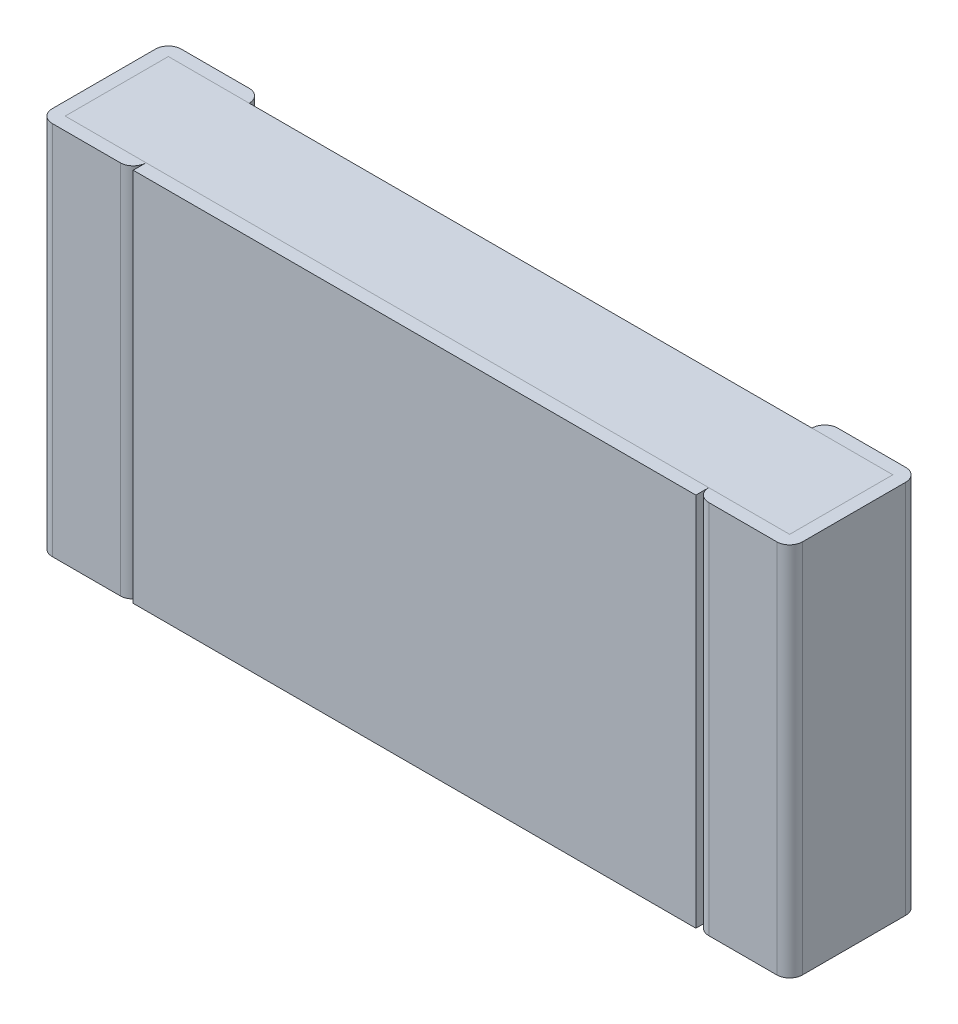
ISO-10303-21;
HEADER;
FILE_DESCRIPTION(('STEP AP214'),'2;1');
FILE_NAME('part.step','',(''),(''),'','','');
FILE_SCHEMA(('AUTOMOTIVE_DESIGN { 1 0 10303 214 1 1 1 1 }'));
ENDSEC;
DATA;
#1=APPLICATION_CONTEXT('core data for automotive mechanical design processes');
#2=APPLICATION_PROTOCOL_DEFINITION('international standard','automotive_design',2000,#1);
#3=PRODUCT_CONTEXT('',#1,'mechanical');
#4=PRODUCT('Part','Part','',(#3));
#5=PRODUCT_RELATED_PRODUCT_CATEGORY('part','',(#4));
#6=PRODUCT_DEFINITION_FORMATION('','',#4);
#7=PRODUCT_DEFINITION_CONTEXT('part definition',#1,'design');
#8=PRODUCT_DEFINITION('design','',#6,#7);
#9=PRODUCT_DEFINITION_SHAPE('','',#8);
#10=(LENGTH_UNIT() NAMED_UNIT(*) SI_UNIT(.MILLI.,.METRE.));
#11=(NAMED_UNIT(*) PLANE_ANGLE_UNIT() SI_UNIT($,.RADIAN.));
#12=(NAMED_UNIT(*) SI_UNIT($,.STERADIAN.) SOLID_ANGLE_UNIT());
#13=UNCERTAINTY_MEASURE_WITH_UNIT(LENGTH_MEASURE(1.E-05),#10,'distance_accuracy_value','');
#14=(GEOMETRIC_REPRESENTATION_CONTEXT(3) GLOBAL_UNCERTAINTY_ASSIGNED_CONTEXT((#13)) GLOBAL_UNIT_ASSIGNED_CONTEXT((#10,
#11,#12)) REPRESENTATION_CONTEXT('',''));
#15=CARTESIAN_POINT('',(0.,0.,0.));
#16=DIRECTION('',(0.,0.,1.));
#17=DIRECTION('',(1.,0.,0.));
#18=AXIS2_PLACEMENT_3D('',#15,#16,#17);
#19=CARTESIAN_POINT('',(-1.2,-0.8,0.55));
#20=DIRECTION('',(0.,0.,1.));
#21=DIRECTION('',(1.,0.,0.));
#22=AXIS2_PLACEMENT_3D('',#19,#20,#21);
#23=PLANE('',#22);
#24=DIRECTION('',(0.,1.,0.));
#25=VECTOR('',#24,1.);
#26=CARTESIAN_POINT('',(-1.2,-0.8,0.55));
#27=LINE('',#26,#25);
#28=CARTESIAN_POINT('',(-1.2,-0.8,0.55));
#29=VERTEX_POINT('',#28);
#30=CARTESIAN_POINT('',(-1.2,0.8,0.55));
#31=VERTEX_POINT('',#30);
#32=EDGE_CURVE('E446',#29,#31,#27,.T.);
#33=ORIENTED_EDGE('',*,*,#32,.F.);
#34=DIRECTION('',(1.,0.,0.));
#35=VECTOR('',#34,1.);
#36=CARTESIAN_POINT('',(-1.2,-0.8,0.55));
#37=LINE('',#36,#35);
#38=CARTESIAN_POINT('',(1.2,-0.8,0.55));
#39=VERTEX_POINT('',#38);
#40=EDGE_CURVE('E439',#29,#39,#37,.T.);
#41=ORIENTED_EDGE('',*,*,#40,.T.);
#42=DIRECTION('',(0.,1.,0.));
#43=VECTOR('',#42,1.);
#44=CARTESIAN_POINT('',(1.2,-0.8,0.55));
#45=LINE('',#44,#43);
#46=CARTESIAN_POINT('',(1.2,0.8,0.55));
#47=VERTEX_POINT('',#46);
#48=EDGE_CURVE('E11',#39,#47,#45,.T.);
#49=ORIENTED_EDGE('',*,*,#48,.T.);
#50=DIRECTION('',(1.,0.,0.));
#51=VECTOR('',#50,1.);
#52=CARTESIAN_POINT('',(-1.2,0.8,0.55));
#53=LINE('',#52,#51);
#54=EDGE_CURVE('E317',#31,#47,#53,.T.);
#55=ORIENTED_EDGE('',*,*,#54,.F.);
#56=EDGE_LOOP('',(#33,#41,#49,#55));
#57=FACE_BOUND('',#56,.T.);
#58=ADVANCED_FACE('F17',(#57),#23,.T.);
#59=CARTESIAN_POINT('',(1.2,-0.8,0.495));
#60=DIRECTION('',(1.,0.,0.));
#61=DIRECTION('',(0.,1.,0.));
#62=AXIS2_PLACEMENT_3D('',#59,#60,#61);
#63=PLANE('',#62);
#64=DIRECTION('',(0.,0.,1.));
#65=VECTOR('',#64,1.);
#66=CARTESIAN_POINT('',(1.2,-0.8,0.495));
#67=LINE('',#66,#65);
#68=CARTESIAN_POINT('',(1.2,-0.8,0.495));
#69=VERTEX_POINT('',#68);
#70=EDGE_CURVE('E435',#69,#39,#67,.T.);
#71=ORIENTED_EDGE('',*,*,#70,.F.);
#72=DIRECTION('',(0.,1.,0.));
#73=VECTOR('',#72,1.);
#74=CARTESIAN_POINT('',(1.2,-0.8,0.495));
#75=LINE('',#74,#73);
#76=CARTESIAN_POINT('',(1.2,0.8,0.495));
#77=VERTEX_POINT('',#76);
#78=EDGE_CURVE('E25',#69,#77,#75,.T.);
#79=ORIENTED_EDGE('',*,*,#78,.T.);
#80=DIRECTION('',(0.,0.,1.));
#81=VECTOR('',#80,1.);
#82=CARTESIAN_POINT('',(1.2,0.8,0.495));
#83=LINE('',#82,#81);
#84=EDGE_CURVE('E266',#77,#47,#83,.T.);
#85=ORIENTED_EDGE('',*,*,#84,.T.);
#86=ORIENTED_EDGE('',*,*,#48,.F.);
#87=EDGE_LOOP('',(#71,#79,#85,#86));
#88=FACE_BOUND('',#87,.T.);
#89=ADVANCED_FACE('F495',(#88),#63,.T.);
#90=CARTESIAN_POINT('',(1.255,-0.8,0.495));
#91=DIRECTION('',(0.,1.,0.));
#92=DIRECTION('',(-1.,0.,0.));
#93=AXIS2_PLACEMENT_3D('',#90,#91,#92);
#94=CYLINDRICAL_SURFACE('',#93,0.055);
#95=CARTESIAN_POINT('',(1.255,-0.8,0.495));
#96=DIRECTION('',(0.,1.,0.));
#97=DIRECTION('',(0.,0.,1.));
#98=AXIS2_PLACEMENT_3D('',#95,#96,#97);
#99=CIRCLE('',#98,0.055);
#100=CARTESIAN_POINT('',(1.255,-0.8,0.55));
#101=VERTEX_POINT('',#100);
#102=EDGE_CURVE('E355',#69,#101,#99,.T.);
#103=ORIENTED_EDGE('',*,*,#102,.T.);
#104=DIRECTION('',(0.,1.,0.));
#105=VECTOR('',#104,1.);
#106=CARTESIAN_POINT('',(1.255,-0.8,0.55));
#107=LINE('',#106,#105);
#108=CARTESIAN_POINT('',(1.255,0.8,0.55));
#109=VERTEX_POINT('',#108);
#110=EDGE_CURVE('E290',#101,#109,#107,.T.);
#111=ORIENTED_EDGE('',*,*,#110,.T.);
#112=CARTESIAN_POINT('',(1.255,0.8,0.495));
#113=DIRECTION('',(0.,1.,0.));
#114=DIRECTION('',(0.,0.,1.));
#115=AXIS2_PLACEMENT_3D('',#112,#113,#114);
#116=CIRCLE('',#115,0.055);
#117=EDGE_CURVE('E370',#77,#109,#116,.T.);
#118=ORIENTED_EDGE('',*,*,#117,.F.);
#119=ORIENTED_EDGE('',*,*,#78,.F.);
#120=EDGE_LOOP('',(#103,#111,#118,#119));
#121=FACE_BOUND('',#120,.T.);
#122=ADVANCED_FACE('F490',(#121),#94,.T.);
#123=CARTESIAN_POINT('',(1.2,-0.8,0.55));
#124=DIRECTION('',(0.,0.,1.));
#125=DIRECTION('',(1.,0.,0.));
#126=AXIS2_PLACEMENT_3D('',#123,#124,#125);
#127=PLANE('',#126);
#128=DIRECTION('',(1.,0.,0.));
#129=VECTOR('',#128,1.);
#130=CARTESIAN_POINT('',(1.2,0.8,0.55));
#131=LINE('',#130,#129);
#132=CARTESIAN_POINT('',(1.545,0.8,0.55));
#133=VERTEX_POINT('',#132);
#134=EDGE_CURVE('E374',#109,#133,#131,.T.);
#135=ORIENTED_EDGE('',*,*,#134,.F.);
#136=ORIENTED_EDGE('',*,*,#110,.F.);
#137=DIRECTION('',(1.,0.,0.));
#138=VECTOR('',#137,1.);
#139=CARTESIAN_POINT('',(1.2,-0.8,0.55));
#140=LINE('',#139,#138);
#141=CARTESIAN_POINT('',(1.545,-0.8,0.55));
#142=VERTEX_POINT('',#141);
#143=EDGE_CURVE('E360',#101,#142,#140,.T.);
#144=ORIENTED_EDGE('',*,*,#143,.T.);
#145=DIRECTION('',(0.,1.,0.));
#146=VECTOR('',#145,1.);
#147=CARTESIAN_POINT('',(1.545,-0.8,0.55));
#148=LINE('',#147,#146);
#149=EDGE_CURVE('E470',#142,#133,#148,.T.);
#150=ORIENTED_EDGE('',*,*,#149,.T.);
#151=EDGE_LOOP('',(#135,#136,#144,#150));
#152=FACE_BOUND('',#151,.T.);
#153=ADVANCED_FACE('F479',(#152),#127,.T.);
#154=CARTESIAN_POINT('',(1.545,-0.8,0.495));
#155=DIRECTION('',(0.,1.,0.));
#156=DIRECTION('',(1.,0.,0.));
#157=AXIS2_PLACEMENT_3D('',#154,#155,#156);
#158=CYLINDRICAL_SURFACE('',#157,0.055);
#159=DIRECTION('',(0.,1.,0.));
#160=VECTOR('',#159,1.);
#161=CARTESIAN_POINT('',(1.6,-0.8,0.495));
#162=LINE('',#161,#160);
#163=CARTESIAN_POINT('',(1.6,-0.8,0.495));
#164=VERTEX_POINT('',#163);
#165=CARTESIAN_POINT('',(1.6,0.8,0.495));
#166=VERTEX_POINT('',#165);
#167=EDGE_CURVE('E297',#164,#166,#162,.T.);
#168=ORIENTED_EDGE('',*,*,#167,.T.);
#169=CARTESIAN_POINT('',(1.545,0.8,0.495));
#170=DIRECTION('',(0.,-1.,0.));
#171=DIRECTION('',(0.,0.,1.));
#172=AXIS2_PLACEMENT_3D('',#169,#170,#171);
#173=CIRCLE('',#172,0.055);
#174=EDGE_CURVE('E459',#166,#133,#173,.T.);
#175=ORIENTED_EDGE('',*,*,#174,.T.);
#176=ORIENTED_EDGE('',*,*,#149,.F.);
#177=CARTESIAN_POINT('',(1.545,-0.8,0.495));
#178=DIRECTION('',(0.,-1.,0.));
#179=DIRECTION('',(0.,0.,1.));
#180=AXIS2_PLACEMENT_3D('',#177,#178,#179);
#181=CIRCLE('',#180,0.055);
#182=EDGE_CURVE('E425',#164,#142,#181,.T.);
#183=ORIENTED_EDGE('',*,*,#182,.F.);
#184=EDGE_LOOP('',(#168,#175,#176,#183));
#185=FACE_BOUND('',#184,.T.);
#186=ADVANCED_FACE('F484',(#185),#158,.T.);
#187=CARTESIAN_POINT('',(1.6,-0.8,0.));
#188=DIRECTION('',(1.,0.,0.));
#189=DIRECTION('',(0.,1.,0.));
#190=AXIS2_PLACEMENT_3D('',#187,#188,#189);
#191=PLANE('',#190);
#192=DIRECTION('',(0.,0.,1.));
#193=VECTOR('',#192,1.);
#194=CARTESIAN_POINT('',(1.6,-0.8,0.));
#195=LINE('',#194,#193);
#196=CARTESIAN_POINT('',(1.6,-0.8,0.055));
#197=VERTEX_POINT('',#196);
#198=EDGE_CURVE('E421',#197,#164,#195,.T.);
#199=ORIENTED_EDGE('',*,*,#198,.F.);
#200=DIRECTION('',(0.,1.,0.));
#201=VECTOR('',#200,1.);
#202=CARTESIAN_POINT('',(1.6,-0.8,0.055));
#203=LINE('',#202,#201);
#204=CARTESIAN_POINT('',(1.6,0.8,0.055));
#205=VERTEX_POINT('',#204);
#206=EDGE_CURVE('E45',#197,#205,#203,.T.);
#207=ORIENTED_EDGE('',*,*,#206,.T.);
#208=DIRECTION('',(0.,0.,1.));
#209=VECTOR('',#208,1.);
#210=CARTESIAN_POINT('',(1.6,0.8,0.));
#211=LINE('',#210,#209);
#212=EDGE_CURVE('E340',#205,#166,#211,.T.);
#213=ORIENTED_EDGE('',*,*,#212,.T.);
#214=ORIENTED_EDGE('',*,*,#167,.F.);
#215=EDGE_LOOP('',(#199,#207,#213,#214));
#216=FACE_BOUND('',#215,.T.);
#217=ADVANCED_FACE('F536',(#216),#191,.T.);
#218=CARTESIAN_POINT('',(1.545,-0.8,0.055));
#219=DIRECTION('',(0.,1.,0.));
#220=DIRECTION('',(1.,0.,0.));
#221=AXIS2_PLACEMENT_3D('',#218,#219,#220);
#222=CYLINDRICAL_SURFACE('',#221,0.055);
#223=CARTESIAN_POINT('',(1.545,-0.8,0.055));
#224=DIRECTION('',(0.,1.,0.));
#225=DIRECTION('',(0.,0.,1.));
#226=AXIS2_PLACEMENT_3D('',#223,#224,#225);
#227=CIRCLE('',#226,0.055);
#228=CARTESIAN_POINT('',(1.545,-0.8,0.));
#229=VERTEX_POINT('',#228);
#230=EDGE_CURVE('E417',#197,#229,#227,.T.);
#231=ORIENTED_EDGE('',*,*,#230,.T.);
#232=DIRECTION('',(0.,1.,0.));
#233=VECTOR('',#232,1.);
#234=CARTESIAN_POINT('',(1.545,-0.8,0.));
#235=LINE('',#234,#233);
#236=CARTESIAN_POINT('',(1.545,0.8,0.));
#237=VERTEX_POINT('',#236);
#238=EDGE_CURVE('E265',#229,#237,#235,.T.);
#239=ORIENTED_EDGE('',*,*,#238,.T.);
#240=CARTESIAN_POINT('',(1.545,0.8,0.055));
#241=DIRECTION('',(0.,1.,0.));
#242=DIRECTION('',(0.,0.,1.));
#243=AXIS2_PLACEMENT_3D('',#240,#241,#242);
#244=CIRCLE('',#243,0.055);
#245=EDGE_CURVE('E321',#205,#237,#244,.T.);
#246=ORIENTED_EDGE('',*,*,#245,.F.);
#247=ORIENTED_EDGE('',*,*,#206,.F.);
#248=EDGE_LOOP('',(#231,#239,#246,#247));
#249=FACE_BOUND('',#248,.T.);
#250=ADVANCED_FACE('F535',(#249),#222,.T.);
#251=CARTESIAN_POINT('',(1.2,-0.8,0.));
#252=DIRECTION('',(0.,0.,1.));
#253=DIRECTION('',(1.,0.,0.));
#254=AXIS2_PLACEMENT_3D('',#251,#252,#253);
#255=PLANE('',#254);
#256=ORIENTED_EDGE('',*,*,#238,.F.);
#257=DIRECTION('',(1.,0.,0.));
#258=VECTOR('',#257,1.);
#259=CARTESIAN_POINT('',(1.2,-0.8,0.));
#260=LINE('',#259,#258);
#261=CARTESIAN_POINT('',(1.255,-0.8,0.));
#262=VERTEX_POINT('',#261);
#263=EDGE_CURVE('E256',#262,#229,#260,.T.);
#264=ORIENTED_EDGE('',*,*,#263,.F.);
#265=DIRECTION('',(0.,1.,0.));
#266=VECTOR('',#265,1.);
#267=CARTESIAN_POINT('',(1.255,-0.8,0.));
#268=LINE('',#267,#266);
#269=CARTESIAN_POINT('',(1.255,0.8,0.));
#270=VERTEX_POINT('',#269);
#271=EDGE_CURVE('E262',#262,#270,#268,.T.);
#272=ORIENTED_EDGE('',*,*,#271,.T.);
#273=DIRECTION('',(1.,0.,0.));
#274=VECTOR('',#273,1.);
#275=CARTESIAN_POINT('',(1.2,0.8,0.));
#276=LINE('',#275,#274);
#277=EDGE_CURVE('E322',#270,#237,#276,.T.);
#278=ORIENTED_EDGE('',*,*,#277,.T.);
#279=EDGE_LOOP('',(#256,#264,#272,#278));
#280=FACE_BOUND('',#279,.T.);
#281=ADVANCED_FACE('F530',(#280),#255,.F.);
#282=CARTESIAN_POINT('',(1.255,-0.8,0.055));
#283=DIRECTION('',(0.,1.,0.));
#284=DIRECTION('',(-1.,0.,0.));
#285=AXIS2_PLACEMENT_3D('',#282,#283,#284);
#286=CYLINDRICAL_SURFACE('',#285,0.055);
#287=DIRECTION('',(0.,1.,0.));
#288=VECTOR('',#287,1.);
#289=CARTESIAN_POINT('',(1.2,-0.8,0.055));
#290=LINE('',#289,#288);
#291=CARTESIAN_POINT('',(1.2,-0.8,0.055));
#292=VERTEX_POINT('',#291);
#293=CARTESIAN_POINT('',(1.2,0.8,0.055));
#294=VERTEX_POINT('',#293);
#295=EDGE_CURVE('E413',#292,#294,#290,.T.);
#296=ORIENTED_EDGE('',*,*,#295,.T.);
#297=CARTESIAN_POINT('',(1.255,0.8,0.055));
#298=DIRECTION('',(0.,-1.,0.));
#299=DIRECTION('',(0.,0.,1.));
#300=AXIS2_PLACEMENT_3D('',#297,#298,#299);
#301=CIRCLE('',#300,0.055);
#302=EDGE_CURVE('E325',#294,#270,#301,.T.);
#303=ORIENTED_EDGE('',*,*,#302,.T.);
#304=ORIENTED_EDGE('',*,*,#271,.F.);
#305=CARTESIAN_POINT('',(1.255,-0.8,0.055));
#306=DIRECTION('',(0.,-1.,0.));
#307=DIRECTION('',(0.,0.,1.));
#308=AXIS2_PLACEMENT_3D('',#305,#306,#307);
#309=CIRCLE('',#308,0.055);
#310=EDGE_CURVE('E359',#292,#262,#309,.T.);
#311=ORIENTED_EDGE('',*,*,#310,.F.);
#312=EDGE_LOOP('',(#296,#303,#304,#311));
#313=FACE_BOUND('',#312,.T.);
#314=ADVANCED_FACE('F527',(#313),#286,.T.);
#315=CARTESIAN_POINT('',(-1.2,0.8,0.495));
#316=DIRECTION('',(0.,1.,0.));
#317=DIRECTION('',(1.,0.,0.));
#318=AXIS2_PLACEMENT_3D('',#315,#316,#317);
#319=PLANE('',#318);
#320=DIRECTION('',(1.,0.,0.));
#321=VECTOR('',#320,1.);
#322=CARTESIAN_POINT('',(-1.2,0.8,0.495));
#323=LINE('',#322,#321);
#324=CARTESIAN_POINT('',(-1.2,0.8,0.495));
#325=VERTEX_POINT('',#324);
#326=EDGE_CURVE('E380',#325,#77,#323,.T.);
#327=ORIENTED_EDGE('',*,*,#326,.F.);
#328=DIRECTION('',(0.,0.,1.));
#329=VECTOR('',#328,1.);
#330=CARTESIAN_POINT('',(-1.2,0.8,0.495));
#331=LINE('',#330,#329);
#332=EDGE_CURVE('E326',#325,#31,#331,.T.);
#333=ORIENTED_EDGE('',*,*,#332,.T.);
#334=ORIENTED_EDGE('',*,*,#54,.T.);
#335=ORIENTED_EDGE('',*,*,#84,.F.);
#336=EDGE_LOOP('',(#327,#333,#334,#335));
#337=FACE_BOUND('',#336,.T.);
#338=ADVANCED_FACE('F591',(#337),#319,.T.);
#339=CARTESIAN_POINT('',(1.2,0.8,0.));
#340=DIRECTION('',(0.,1.,0.));
#341=DIRECTION('',(1.,0.,0.));
#342=AXIS2_PLACEMENT_3D('',#339,#340,#341);
#343=PLANE('',#342);
#344=ORIENTED_EDGE('',*,*,#277,.F.);
#345=ORIENTED_EDGE('',*,*,#302,.F.);
#346=DIRECTION('',(1.,0.,0.));
#347=VECTOR('',#346,1.);
#348=CARTESIAN_POINT('',(-1.545,0.8,0.055));
#349=LINE('',#348,#347);
#350=CARTESIAN_POINT('',(1.545,0.8,0.055));
#351=VERTEX_POINT('',#350);
#352=EDGE_CURVE('E406',#294,#351,#349,.T.);
#353=ORIENTED_EDGE('',*,*,#352,.T.);
#354=DIRECTION('',(0.,0.,1.));
#355=VECTOR('',#354,1.);
#356=CARTESIAN_POINT('',(1.545,0.8,0.055));
#357=LINE('',#356,#355);
#358=CARTESIAN_POINT('',(1.545,0.8,0.495));
#359=VERTEX_POINT('',#358);
#360=EDGE_CURVE('E379',#351,#359,#357,.T.);
#361=ORIENTED_EDGE('',*,*,#360,.T.);
#362=DIRECTION('',(1.,0.,0.));
#363=VECTOR('',#362,1.);
#364=CARTESIAN_POINT('',(-1.545,0.8,0.495));
#365=LINE('',#364,#363);
#366=EDGE_CURVE('E375',#77,#359,#365,.T.);
#367=ORIENTED_EDGE('',*,*,#366,.F.);
#368=ORIENTED_EDGE('',*,*,#117,.T.);
#369=ORIENTED_EDGE('',*,*,#134,.T.);
#370=ORIENTED_EDGE('',*,*,#174,.F.);
#371=ORIENTED_EDGE('',*,*,#212,.F.);
#372=ORIENTED_EDGE('',*,*,#245,.T.);
#373=EDGE_LOOP('',(#344,#345,#353,#361,#367,#368,#369,#370,#371,#372));
#374=FACE_BOUND('',#373,.T.);
#375=ADVANCED_FACE('F488',(#374),#343,.T.);
#376=CARTESIAN_POINT('',(-1.2,-0.8,0.495));
#377=DIRECTION('',(1.,0.,0.));
#378=DIRECTION('',(0.,1.,0.));
#379=AXIS2_PLACEMENT_3D('',#376,#377,#378);
#380=PLANE('',#379);
#381=ORIENTED_EDGE('',*,*,#32,.T.);
#382=ORIENTED_EDGE('',*,*,#332,.F.);
#383=DIRECTION('',(0.,1.,0.));
#384=VECTOR('',#383,1.);
#385=CARTESIAN_POINT('',(-1.2,-0.8,0.495));
#386=LINE('',#385,#384);
#387=CARTESIAN_POINT('',(-1.2,-0.8,0.495));
#388=VERTEX_POINT('',#387);
#389=EDGE_CURVE('E397',#388,#325,#386,.T.);
#390=ORIENTED_EDGE('',*,*,#389,.F.);
#391=DIRECTION('',(0.,0.,1.));
#392=VECTOR('',#391,1.);
#393=CARTESIAN_POINT('',(-1.2,-0.8,0.495));
#394=LINE('',#393,#392);
#395=EDGE_CURVE('E442',#388,#29,#394,.T.);
#396=ORIENTED_EDGE('',*,*,#395,.T.);
#397=EDGE_LOOP('',(#381,#382,#390,#396));
#398=FACE_BOUND('',#397,.T.);
#399=ADVANCED_FACE('F551',(#398),#380,.F.);
#400=CARTESIAN_POINT('',(-1.2,-0.8,0.495));
#401=DIRECTION('',(0.,1.,0.));
#402=DIRECTION('',(1.,0.,0.));
#403=AXIS2_PLACEMENT_3D('',#400,#401,#402);
#404=PLANE('',#403);
#405=ORIENTED_EDGE('',*,*,#70,.T.);
#406=ORIENTED_EDGE('',*,*,#40,.F.);
#407=ORIENTED_EDGE('',*,*,#395,.F.);
#408=DIRECTION('',(1.,0.,0.));
#409=VECTOR('',#408,1.);
#410=CARTESIAN_POINT('',(-1.2,-0.8,0.495));
#411=LINE('',#410,#409);
#412=EDGE_CURVE('E345',#388,#69,#411,.T.);
#413=ORIENTED_EDGE('',*,*,#412,.T.);
#414=EDGE_LOOP('',(#405,#406,#407,#413));
#415=FACE_BOUND('',#414,.T.);
#416=ADVANCED_FACE('F503',(#415),#404,.F.);
#417=CARTESIAN_POINT('',(1.2,-0.8,0.));
#418=DIRECTION('',(0.,1.,0.));
#419=DIRECTION('',(1.,0.,0.));
#420=AXIS2_PLACEMENT_3D('',#417,#418,#419);
#421=PLANE('',#420);
#422=ORIENTED_EDGE('',*,*,#230,.F.);
#423=ORIENTED_EDGE('',*,*,#198,.T.);
#424=ORIENTED_EDGE('',*,*,#182,.T.);
#425=ORIENTED_EDGE('',*,*,#143,.F.);
#426=ORIENTED_EDGE('',*,*,#102,.F.);
#427=DIRECTION('',(1.,0.,0.));
#428=VECTOR('',#427,1.);
#429=CARTESIAN_POINT('',(-1.545,-0.8,0.495));
#430=LINE('',#429,#428);
#431=CARTESIAN_POINT('',(1.545,-0.8,0.495));
#432=VERTEX_POINT('',#431);
#433=EDGE_CURVE('E350',#69,#432,#430,.T.);
#434=ORIENTED_EDGE('',*,*,#433,.T.);
#435=DIRECTION('',(0.,0.,1.));
#436=VECTOR('',#435,1.);
#437=CARTESIAN_POINT('',(1.545,-0.8,0.055));
#438=LINE('',#437,#436);
#439=CARTESIAN_POINT('',(1.545,-0.8,0.055));
#440=VERTEX_POINT('',#439);
#441=EDGE_CURVE('E389',#440,#432,#438,.T.);
#442=ORIENTED_EDGE('',*,*,#441,.F.);
#443=DIRECTION('',(1.,0.,0.));
#444=VECTOR('',#443,1.);
#445=CARTESIAN_POINT('',(-1.545,-0.8,0.055));
#446=LINE('',#445,#444);
#447=EDGE_CURVE('E332',#292,#440,#446,.T.);
#448=ORIENTED_EDGE('',*,*,#447,.F.);
#449=ORIENTED_EDGE('',*,*,#310,.T.);
#450=ORIENTED_EDGE('',*,*,#263,.T.);
#451=EDGE_LOOP('',(#422,#423,#424,#425,#426,#434,#442,#448,#449,#450));
#452=FACE_BOUND('',#451,.T.);
#453=ADVANCED_FACE('F500',(#452),#421,.F.);
#454=CARTESIAN_POINT('',(-1.545,-0.8,0.055));
#455=DIRECTION('',(0.,0.,1.));
#456=DIRECTION('',(1.,0.,0.));
#457=AXIS2_PLACEMENT_3D('',#454,#455,#456);
#458=PLANE('',#457);
#459=DIRECTION('',(1.,0.,0.));
#460=VECTOR('',#459,1.);
#461=CARTESIAN_POINT('',(-1.545,0.8,0.055));
#462=LINE('',#461,#460);
#463=CARTESIAN_POINT('',(-1.2,0.8,0.055));
#464=VERTEX_POINT('',#463);
#465=EDGE_CURVE('E409',#464,#294,#462,.T.);
#466=ORIENTED_EDGE('',*,*,#465,.T.);
#467=ORIENTED_EDGE('',*,*,#295,.F.);
#468=DIRECTION('',(1.,0.,0.));
#469=VECTOR('',#468,1.);
#470=CARTESIAN_POINT('',(-1.545,-0.8,0.055));
#471=LINE('',#470,#469);
#472=CARTESIAN_POINT('',(-1.2,-0.8,0.055));
#473=VERTEX_POINT('',#472);
#474=EDGE_CURVE('E328',#473,#292,#471,.T.);
#475=ORIENTED_EDGE('',*,*,#474,.F.);
#476=DIRECTION('',(0.,1.,0.));
#477=VECTOR('',#476,1.);
#478=CARTESIAN_POINT('',(-1.2,-0.8,0.055));
#479=LINE('',#478,#477);
#480=EDGE_CURVE('E333',#473,#464,#479,.T.);
#481=ORIENTED_EDGE('',*,*,#480,.T.);
#482=EDGE_LOOP('',(#466,#467,#475,#481));
#483=FACE_BOUND('',#482,.T.);
#484=ADVANCED_FACE('F514',(#483),#458,.F.);
#485=CARTESIAN_POINT('',(-1.545,0.8,0.055));
#486=DIRECTION('',(0.,1.,0.));
#487=DIRECTION('',(1.,0.,0.));
#488=AXIS2_PLACEMENT_3D('',#485,#486,#487);
#489=PLANE('',#488);
#490=DIRECTION('',(1.,0.,0.));
#491=VECTOR('',#490,1.);
#492=CARTESIAN_POINT('',(-1.545,0.8,0.055));
#493=LINE('',#492,#491);
#494=CARTESIAN_POINT('',(-1.545,0.8,0.055));
#495=VERTEX_POINT('',#494);
#496=EDGE_CURVE('E276',#495,#464,#493,.T.);
#497=ORIENTED_EDGE('',*,*,#496,.F.);
#498=DIRECTION('',(0.,0.,1.));
#499=VECTOR('',#498,1.);
#500=CARTESIAN_POINT('',(-1.545,0.8,0.055));
#501=LINE('',#500,#499);
#502=CARTESIAN_POINT('',(-1.545,0.8,0.495));
#503=VERTEX_POINT('',#502);
#504=EDGE_CURVE('E364',#495,#503,#501,.T.);
#505=ORIENTED_EDGE('',*,*,#504,.T.);
#506=DIRECTION('',(1.,0.,0.));
#507=VECTOR('',#506,1.);
#508=CARTESIAN_POINT('',(-1.545,0.8,0.495));
#509=LINE('',#508,#507);
#510=EDGE_CURVE('E354',#503,#325,#509,.T.);
#511=ORIENTED_EDGE('',*,*,#510,.T.);
#512=ORIENTED_EDGE('',*,*,#326,.T.);
#513=ORIENTED_EDGE('',*,*,#366,.T.);
#514=ORIENTED_EDGE('',*,*,#360,.F.);
#515=ORIENTED_EDGE('',*,*,#352,.F.);
#516=ORIENTED_EDGE('',*,*,#465,.F.);
#517=EDGE_LOOP('',(#497,#505,#511,#512,#513,#514,#515,#516));
#518=FACE_BOUND('',#517,.T.);
#519=ADVANCED_FACE('F523',(#518),#489,.T.);
#520=CARTESIAN_POINT('',(-1.255,-0.8,0.495));
#521=DIRECTION('',(0.,1.,0.));
#522=DIRECTION('',(1.,0.,0.));
#523=AXIS2_PLACEMENT_3D('',#520,#521,#522);
#524=CYLINDRICAL_SURFACE('',#523,0.055);
#525=ORIENTED_EDGE('',*,*,#389,.T.);
#526=CARTESIAN_POINT('',(-1.255,0.8,0.495));
#527=DIRECTION('',(0.,-1.,0.));
#528=DIRECTION('',(0.,0.,1.));
#529=AXIS2_PLACEMENT_3D('',#526,#527,#528);
#530=CIRCLE('',#529,0.055);
#531=CARTESIAN_POINT('',(-1.255,0.8,0.55));
#532=VERTEX_POINT('',#531);
#533=EDGE_CURVE('E282',#325,#532,#530,.T.);
#534=ORIENTED_EDGE('',*,*,#533,.T.);
#535=DIRECTION('',(0.,1.,0.));
#536=VECTOR('',#535,1.);
#537=CARTESIAN_POINT('',(-1.255,-0.8,0.55));
#538=LINE('',#537,#536);
#539=CARTESIAN_POINT('',(-1.255,-0.8,0.55));
#540=VERTEX_POINT('',#539);
#541=EDGE_CURVE('E349',#540,#532,#538,.T.);
#542=ORIENTED_EDGE('',*,*,#541,.F.);
#543=CARTESIAN_POINT('',(-1.255,-0.8,0.495));
#544=DIRECTION('',(0.,-1.,0.));
#545=DIRECTION('',(0.,0.,1.));
#546=AXIS2_PLACEMENT_3D('',#543,#544,#545);
#547=CIRCLE('',#546,0.055);
#548=EDGE_CURVE('E258',#388,#540,#547,.T.);
#549=ORIENTED_EDGE('',*,*,#548,.F.);
#550=EDGE_LOOP('',(#525,#534,#542,#549));
#551=FACE_BOUND('',#550,.T.);
#552=ADVANCED_FACE('F554',(#551),#524,.T.);
#553=CARTESIAN_POINT('',(-1.6,-0.8,0.55));
#554=DIRECTION('',(0.,0.,1.));
#555=DIRECTION('',(1.,0.,0.));
#556=AXIS2_PLACEMENT_3D('',#553,#554,#555);
#557=PLANE('',#556);
#558=DIRECTION('',(1.,0.,0.));
#559=VECTOR('',#558,1.);
#560=CARTESIAN_POINT('',(-1.6,0.8,0.55));
#561=LINE('',#560,#559);
#562=CARTESIAN_POINT('',(-1.545,0.8,0.55));
#563=VERTEX_POINT('',#562);
#564=EDGE_CURVE('E278',#563,#532,#561,.T.);
#565=ORIENTED_EDGE('',*,*,#564,.F.);
#566=DIRECTION('',(0.,1.,0.));
#567=VECTOR('',#566,1.);
#568=CARTESIAN_POINT('',(-1.545,-0.8,0.55));
#569=LINE('',#568,#567);
#570=CARTESIAN_POINT('',(-1.545,-0.8,0.55));
#571=VERTEX_POINT('',#570);
#572=EDGE_CURVE('E316',#571,#563,#569,.T.);
#573=ORIENTED_EDGE('',*,*,#572,.F.);
#574=DIRECTION('',(1.,0.,0.));
#575=VECTOR('',#574,1.);
#576=CARTESIAN_POINT('',(-1.6,-0.8,0.55));
#577=LINE('',#576,#575);
#578=EDGE_CURVE('E225',#571,#540,#577,.T.);
#579=ORIENTED_EDGE('',*,*,#578,.T.);
#580=ORIENTED_EDGE('',*,*,#541,.T.);
#581=EDGE_LOOP('',(#565,#573,#579,#580));
#582=FACE_BOUND('',#581,.T.);
#583=ADVANCED_FACE('F557',(#582),#557,.T.);
#584=CARTESIAN_POINT('',(-1.545,-0.8,0.055));
#585=DIRECTION('',(0.,1.,0.));
#586=DIRECTION('',(1.,0.,0.));
#587=AXIS2_PLACEMENT_3D('',#584,#585,#586);
#588=PLANE('',#587);
#589=ORIENTED_EDGE('',*,*,#474,.T.);
#590=ORIENTED_EDGE('',*,*,#447,.T.);
#591=ORIENTED_EDGE('',*,*,#441,.T.);
#592=ORIENTED_EDGE('',*,*,#433,.F.);
#593=ORIENTED_EDGE('',*,*,#412,.F.);
#594=DIRECTION('',(1.,0.,0.));
#595=VECTOR('',#594,1.);
#596=CARTESIAN_POINT('',(-1.545,-0.8,0.495));
#597=LINE('',#596,#595);
#598=CARTESIAN_POINT('',(-1.545,-0.8,0.495));
#599=VERTEX_POINT('',#598);
#600=EDGE_CURVE('E301',#599,#388,#597,.T.);
#601=ORIENTED_EDGE('',*,*,#600,.F.);
#602=DIRECTION('',(0.,0.,1.));
#603=VECTOR('',#602,1.);
#604=CARTESIAN_POINT('',(-1.545,-0.8,0.055));
#605=LINE('',#604,#603);
#606=CARTESIAN_POINT('',(-1.545,-0.8,0.055));
#607=VERTEX_POINT('',#606);
#608=EDGE_CURVE('E294',#607,#599,#605,.T.);
#609=ORIENTED_EDGE('',*,*,#608,.F.);
#610=DIRECTION('',(1.,0.,0.));
#611=VECTOR('',#610,1.);
#612=CARTESIAN_POINT('',(-1.545,-0.8,0.055));
#613=LINE('',#612,#611);
#614=EDGE_CURVE('E287',#607,#473,#613,.T.);
#615=ORIENTED_EDGE('',*,*,#614,.T.);
#616=EDGE_LOOP('',(#589,#590,#591,#592,#593,#601,#609,#615));
#617=FACE_BOUND('',#616,.T.);
#618=ADVANCED_FACE('F507',(#617),#588,.F.);
#619=CARTESIAN_POINT('',(-1.255,-0.8,0.055));
#620=DIRECTION('',(0.,1.,0.));
#621=DIRECTION('',(1.,0.,0.));
#622=AXIS2_PLACEMENT_3D('',#619,#620,#621);
#623=CYLINDRICAL_SURFACE('',#622,0.055);
#624=CARTESIAN_POINT('',(-1.255,-0.8,0.055));
#625=DIRECTION('',(0.,1.,0.));
#626=DIRECTION('',(0.,0.,1.));
#627=AXIS2_PLACEMENT_3D('',#624,#625,#626);
#628=CIRCLE('',#627,0.055);
#629=CARTESIAN_POINT('',(-1.255,-0.8,0.));
#630=VERTEX_POINT('',#629);
#631=EDGE_CURVE('E240',#473,#630,#628,.T.);
#632=ORIENTED_EDGE('',*,*,#631,.T.);
#633=DIRECTION('',(0.,1.,0.));
#634=VECTOR('',#633,1.);
#635=CARTESIAN_POINT('',(-1.255,-0.8,0.));
#636=LINE('',#635,#634);
#637=CARTESIAN_POINT('',(-1.255,0.8,0.));
#638=VERTEX_POINT('',#637);
#639=EDGE_CURVE('E275',#630,#638,#636,.T.);
#640=ORIENTED_EDGE('',*,*,#639,.T.);
#641=CARTESIAN_POINT('',(-1.255,0.8,0.055));
#642=DIRECTION('',(0.,1.,0.));
#643=DIRECTION('',(0.,0.,1.));
#644=AXIS2_PLACEMENT_3D('',#641,#642,#643);
#645=CIRCLE('',#644,0.055);
#646=EDGE_CURVE('E272',#464,#638,#645,.T.);
#647=ORIENTED_EDGE('',*,*,#646,.F.);
#648=ORIENTED_EDGE('',*,*,#480,.F.);
#649=EDGE_LOOP('',(#632,#640,#647,#648));
#650=FACE_BOUND('',#649,.T.);
#651=ADVANCED_FACE('F517',(#650),#623,.T.);
#652=CARTESIAN_POINT('',(-1.6,-0.8,0.));
#653=DIRECTION('',(0.,0.,1.));
#654=DIRECTION('',(1.,0.,0.));
#655=AXIS2_PLACEMENT_3D('',#652,#653,#654);
#656=PLANE('',#655);
#657=ORIENTED_EDGE('',*,*,#639,.F.);
#658=DIRECTION('',(1.,0.,0.));
#659=VECTOR('',#658,1.);
#660=CARTESIAN_POINT('',(-1.6,-0.8,0.));
#661=LINE('',#660,#659);
#662=CARTESIAN_POINT('',(-1.545,-0.8,0.));
#663=VERTEX_POINT('',#662);
#664=EDGE_CURVE('E267',#663,#630,#661,.T.);
#665=ORIENTED_EDGE('',*,*,#664,.F.);
#666=DIRECTION('',(0.,1.,0.));
#667=VECTOR('',#666,1.);
#668=CARTESIAN_POINT('',(-1.545,-0.8,0.));
#669=LINE('',#668,#667);
#670=CARTESIAN_POINT('',(-1.545,0.8,0.));
#671=VERTEX_POINT('',#670);
#672=EDGE_CURVE('E312',#663,#671,#669,.T.);
#673=ORIENTED_EDGE('',*,*,#672,.T.);
#674=DIRECTION('',(1.,0.,0.));
#675=VECTOR('',#674,1.);
#676=CARTESIAN_POINT('',(-1.6,0.8,0.));
#677=LINE('',#676,#675);
#678=EDGE_CURVE('E283',#671,#638,#677,.T.);
#679=ORIENTED_EDGE('',*,*,#678,.T.);
#680=EDGE_LOOP('',(#657,#665,#673,#679));
#681=FACE_BOUND('',#680,.T.);
#682=ADVANCED_FACE('F560',(#681),#656,.F.);
#683=CARTESIAN_POINT('',(-1.6,0.8,0.));
#684=DIRECTION('',(0.,1.,0.));
#685=DIRECTION('',(1.,0.,0.));
#686=AXIS2_PLACEMENT_3D('',#683,#684,#685);
#687=PLANE('',#686);
#688=ORIENTED_EDGE('',*,*,#678,.F.);
#689=CARTESIAN_POINT('',(-1.545,0.8,0.055));
#690=DIRECTION('',(0.,-1.,0.));
#691=DIRECTION('',(0.,0.,1.));
#692=AXIS2_PLACEMENT_3D('',#689,#690,#691);
#693=CIRCLE('',#692,0.055);
#694=CARTESIAN_POINT('',(-1.6,0.8,0.055));
#695=VERTEX_POINT('',#694);
#696=EDGE_CURVE('E271',#695,#671,#693,.T.);
#697=ORIENTED_EDGE('',*,*,#696,.F.);
#698=DIRECTION('',(0.,0.,1.));
#699=VECTOR('',#698,1.);
#700=CARTESIAN_POINT('',(-1.6,0.8,0.));
#701=LINE('',#700,#699);
#702=CARTESIAN_POINT('',(-1.6,0.8,0.495));
#703=VERTEX_POINT('',#702);
#704=EDGE_CURVE('E247',#695,#703,#701,.T.);
#705=ORIENTED_EDGE('',*,*,#704,.T.);
#706=CARTESIAN_POINT('',(-1.545,0.8,0.495));
#707=DIRECTION('',(0.,1.,0.));
#708=DIRECTION('',(0.,0.,1.));
#709=AXIS2_PLACEMENT_3D('',#706,#707,#708);
#710=CIRCLE('',#709,0.055);
#711=EDGE_CURVE('E244',#703,#563,#710,.T.);
#712=ORIENTED_EDGE('',*,*,#711,.T.);
#713=ORIENTED_EDGE('',*,*,#564,.T.);
#714=ORIENTED_EDGE('',*,*,#533,.F.);
#715=ORIENTED_EDGE('',*,*,#510,.F.);
#716=ORIENTED_EDGE('',*,*,#504,.F.);
#717=ORIENTED_EDGE('',*,*,#496,.T.);
#718=ORIENTED_EDGE('',*,*,#646,.T.);
#719=EDGE_LOOP('',(#688,#697,#705,#712,#713,#714,#715,#716,#717,#718));
#720=FACE_BOUND('',#719,.T.);
#721=ADVANCED_FACE('F520',(#720),#687,.T.);
#722=CARTESIAN_POINT('',(-1.545,-0.8,0.495));
#723=DIRECTION('',(0.,1.,0.));
#724=DIRECTION('',(-1.,0.,0.));
#725=AXIS2_PLACEMENT_3D('',#722,#723,#724);
#726=CYLINDRICAL_SURFACE('',#725,0.055);
#727=CARTESIAN_POINT('',(-1.545,-0.8,0.495));
#728=DIRECTION('',(0.,1.,0.));
#729=DIRECTION('',(0.,0.,1.));
#730=AXIS2_PLACEMENT_3D('',#727,#728,#729);
#731=CIRCLE('',#730,0.055);
#732=CARTESIAN_POINT('',(-1.6,-0.8,0.495));
#733=VERTEX_POINT('',#732);
#734=EDGE_CURVE('E216',#733,#571,#731,.T.);
#735=ORIENTED_EDGE('',*,*,#734,.T.);
#736=ORIENTED_EDGE('',*,*,#572,.T.);
#737=ORIENTED_EDGE('',*,*,#711,.F.);
#738=DIRECTION('',(0.,1.,0.));
#739=VECTOR('',#738,1.);
#740=CARTESIAN_POINT('',(-1.6,-0.8,0.495));
#741=LINE('',#740,#739);
#742=EDGE_CURVE('E236',#733,#703,#741,.T.);
#743=ORIENTED_EDGE('',*,*,#742,.F.);
#744=EDGE_LOOP('',(#735,#736,#737,#743));
#745=FACE_BOUND('',#744,.T.);
#746=ADVANCED_FACE('F242',(#745),#726,.T.);
#747=CARTESIAN_POINT('',(-1.545,-0.8,0.055));
#748=DIRECTION('',(0.,1.,0.));
#749=DIRECTION('',(-1.,0.,0.));
#750=AXIS2_PLACEMENT_3D('',#747,#748,#749);
#751=CYLINDRICAL_SURFACE('',#750,0.055);
#752=DIRECTION('',(0.,1.,0.));
#753=VECTOR('',#752,1.);
#754=CARTESIAN_POINT('',(-1.6,-0.8,0.055));
#755=LINE('',#754,#753);
#756=CARTESIAN_POINT('',(-1.6,-0.8,0.055));
#757=VERTEX_POINT('',#756);
#758=EDGE_CURVE('E238',#757,#695,#755,.T.);
#759=ORIENTED_EDGE('',*,*,#758,.T.);
#760=ORIENTED_EDGE('',*,*,#696,.T.);
#761=ORIENTED_EDGE('',*,*,#672,.F.);
#762=CARTESIAN_POINT('',(-1.545,-0.8,0.055));
#763=DIRECTION('',(0.,-1.,0.));
#764=DIRECTION('',(0.,0.,1.));
#765=AXIS2_PLACEMENT_3D('',#762,#763,#764);
#766=CIRCLE('',#765,0.055);
#767=EDGE_CURVE('E230',#757,#663,#766,.T.);
#768=ORIENTED_EDGE('',*,*,#767,.F.);
#769=EDGE_LOOP('',(#759,#760,#761,#768));
#770=FACE_BOUND('',#769,.T.);
#771=ADVANCED_FACE('F562',(#770),#751,.T.);
#772=CARTESIAN_POINT('',(-1.6,-0.8,0.));
#773=DIRECTION('',(0.,1.,0.));
#774=DIRECTION('',(1.,0.,0.));
#775=AXIS2_PLACEMENT_3D('',#772,#773,#774);
#776=PLANE('',#775);
#777=ORIENTED_EDGE('',*,*,#631,.F.);
#778=ORIENTED_EDGE('',*,*,#614,.F.);
#779=ORIENTED_EDGE('',*,*,#608,.T.);
#780=ORIENTED_EDGE('',*,*,#600,.T.);
#781=ORIENTED_EDGE('',*,*,#548,.T.);
#782=ORIENTED_EDGE('',*,*,#578,.F.);
#783=ORIENTED_EDGE('',*,*,#734,.F.);
#784=DIRECTION('',(0.,0.,1.));
#785=VECTOR('',#784,1.);
#786=CARTESIAN_POINT('',(-1.6,-0.8,0.));
#787=LINE('',#786,#785);
#788=EDGE_CURVE('E221',#757,#733,#787,.T.);
#789=ORIENTED_EDGE('',*,*,#788,.F.);
#790=ORIENTED_EDGE('',*,*,#767,.T.);
#791=ORIENTED_EDGE('',*,*,#664,.T.);
#792=EDGE_LOOP('',(#777,#778,#779,#780,#781,#782,#783,#789,#790,#791));
#793=FACE_BOUND('',#792,.T.);
#794=ADVANCED_FACE('F219',(#793),#776,.F.);
#795=CARTESIAN_POINT('',(-1.6,-0.8,0.));
#796=DIRECTION('',(1.,0.,0.));
#797=DIRECTION('',(0.,1.,0.));
#798=AXIS2_PLACEMENT_3D('',#795,#796,#797);
#799=PLANE('',#798);
#800=ORIENTED_EDGE('',*,*,#742,.T.);
#801=ORIENTED_EDGE('',*,*,#704,.F.);
#802=ORIENTED_EDGE('',*,*,#758,.F.);
#803=ORIENTED_EDGE('',*,*,#788,.T.);
#804=EDGE_LOOP('',(#800,#801,#802,#803));
#805=FACE_BOUND('',#804,.T.);
#806=ADVANCED_FACE('F234',(#805),#799,.F.);
#807=CLOSED_SHELL('',(#58,#89,#122,#153,#186,#217,#250,#281,#314,#338,#375,#399,#416,#453,#484,
#519,#552,#583,#618,#651,#682,#721,#746,#771,#794,#806));
#808=MANIFOLD_SOLID_BREP('B1',#807);
#809=ADVANCED_BREP_SHAPE_REPRESENTATION('',(#18,#808),#14);
#810=SHAPE_DEFINITION_REPRESENTATION(#9,#809);
ENDSEC;
END-ISO-10303-21;
